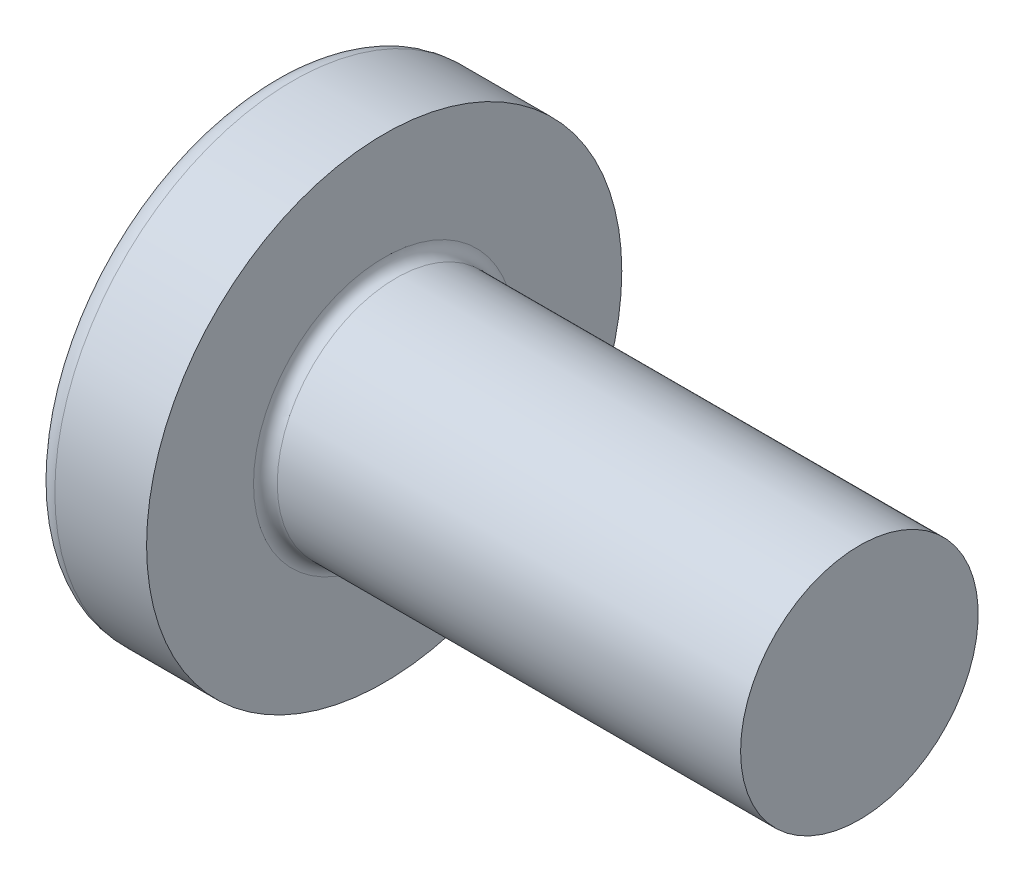
ISO-10303-21;
HEADER;
FILE_DESCRIPTION(('STEP AP214'),'2;1');
FILE_NAME('part.step','',(''),(''),'','','');
FILE_SCHEMA(('AUTOMOTIVE_DESIGN { 1 0 10303 214 1 1 1 1 }'));
ENDSEC;
DATA;
#1=APPLICATION_CONTEXT('core data for automotive mechanical design processes');
#2=APPLICATION_PROTOCOL_DEFINITION('international standard','automotive_design',2000,#1);
#3=PRODUCT_CONTEXT('',#1,'mechanical');
#4=PRODUCT('Part','Part','',(#3));
#5=PRODUCT_RELATED_PRODUCT_CATEGORY('part','',(#4));
#6=PRODUCT_DEFINITION_FORMATION('','',#4);
#7=PRODUCT_DEFINITION_CONTEXT('part definition',#1,'design');
#8=PRODUCT_DEFINITION('design','',#6,#7);
#9=PRODUCT_DEFINITION_SHAPE('','',#8);
#10=(LENGTH_UNIT() NAMED_UNIT(*) SI_UNIT(.MILLI.,.METRE.));
#11=(NAMED_UNIT(*) PLANE_ANGLE_UNIT() SI_UNIT($,.RADIAN.));
#12=(NAMED_UNIT(*) SI_UNIT($,.STERADIAN.) SOLID_ANGLE_UNIT());
#13=UNCERTAINTY_MEASURE_WITH_UNIT(LENGTH_MEASURE(1.E-05),#10,'distance_accuracy_value','');
#14=(GEOMETRIC_REPRESENTATION_CONTEXT(3) GLOBAL_UNCERTAINTY_ASSIGNED_CONTEXT((#13)) GLOBAL_UNIT_ASSIGNED_CONTEXT((#10,
#11,#12)) REPRESENTATION_CONTEXT('',''));
#15=CARTESIAN_POINT('',(0.,0.,0.));
#16=DIRECTION('',(0.,0.,1.));
#17=DIRECTION('',(1.,0.,0.));
#18=AXIS2_PLACEMENT_3D('',#15,#16,#17);
#19=CARTESIAN_POINT('',(6.5,0.,0.));
#20=DIRECTION('',(-1.,0.,0.));
#21=DIRECTION('',(0.,1.,0.));
#22=AXIS2_PLACEMENT_3D('',#19,#20,#21);
#23=SPHERICAL_SURFACE('',#22,6.5);
#24=CARTESIAN_POINT('',(1.26538895452803,0.,0.));
#25=DIRECTION('',(-1.,0.,0.));
#26=DIRECTION('',(0.,0.,1.));
#27=AXIS2_PLACEMENT_3D('',#24,#25,#26);
#28=CIRCLE('',#27,3.85342019543974);
#29=CARTESIAN_POINT('',(1.26538895452803,0.,3.85342019543974));
#30=VERTEX_POINT('',#29);
#31=EDGE_CURVE('E213',#30,#30,#28,.T.);
#32=ORIENTED_EDGE('',*,*,#31,.T.);
#33=EDGE_LOOP('',(#32));
#34=FACE_BOUND('',#33,.T.);
#35=CARTESIAN_POINT('',(0.0788099820016241,0.,0.));
#36=DIRECTION('',(1.,0.,0.));
#37=DIRECTION('',(0.,0.,-1.));
#38=AXIS2_PLACEMENT_3D('',#35,#36,#37);
#39=CIRCLE('',#38,1.0091178091571);
#40=CARTESIAN_POINT('',(0.0788099820016251,-0.514999999999997,-0.867809744562727));
#41=VERTEX_POINT('',#40);
#42=CARTESIAN_POINT('',(0.0788099820016241,-0.867809744562722,-0.515));
#43=VERTEX_POINT('',#42);
#44=EDGE_CURVE('E402',#41,#43,#39,.F.);
#45=ORIENTED_EDGE('',*,*,#44,.F.);
#46=CARTESIAN_POINT('',(6.5,-0.515,0.));
#47=DIRECTION('',(0.,1.,0.));
#48=DIRECTION('',(0.,0.,1.));
#49=AXIS2_PLACEMENT_3D('',#46,#47,#48);
#50=CIRCLE('',#49,6.47956595768575);
#51=CARTESIAN_POINT('',(0.331830514069448,-0.514999999999993,-1.98455541440274));
#52=VERTEX_POINT('',#51);
#53=EDGE_CURVE('E258',#52,#41,#50,.T.);
#54=ORIENTED_EDGE('',*,*,#53,.F.);
#55=CARTESIAN_POINT('',(6.06443205224295,0.,0.873614180207961));
#56=DIRECTION('',(0.446197800778958,0.,-0.89493436774996));
#57=DIRECTION('',(-0.89493436774996,0.,-0.446197800778958));
#58=AXIS2_PLACEMENT_3D('',#55,#56,#57);
#59=CIRCLE('',#58,6.4262803258982);
#60=CARTESIAN_POINT('',(0.331830514069448,0.515000000000007,-1.98455541440274));
#61=VERTEX_POINT('',#60);
#62=EDGE_CURVE('E232',#52,#61,#59,.T.);
#63=ORIENTED_EDGE('',*,*,#62,.T.);
#64=CARTESIAN_POINT('',(6.5,0.515,0.));
#65=DIRECTION('',(0.,-1.,0.));
#66=DIRECTION('',(0.,0.,-1.));
#67=AXIS2_PLACEMENT_3D('',#64,#65,#66);
#68=CIRCLE('',#67,6.47956595768575);
#69=CARTESIAN_POINT('',(0.0788099820016249,0.515000000000003,-0.867809744562724));
#70=VERTEX_POINT('',#69);
#71=EDGE_CURVE('E266',#70,#61,#68,.T.);
#72=ORIENTED_EDGE('',*,*,#71,.F.);
#73=CARTESIAN_POINT('',(0.0788099820016241,0.867809744562721,-0.515));
#74=VERTEX_POINT('',#73);
#75=EDGE_CURVE('E334',#74,#70,#39,.F.);
#76=ORIENTED_EDGE('',*,*,#75,.F.);
#77=CARTESIAN_POINT('',(6.5,0.,-0.515));
#78=DIRECTION('',(0.,0.,1.));
#79=DIRECTION('',(1.,0.,0.));
#80=AXIS2_PLACEMENT_3D('',#77,#78,#79);
#81=CIRCLE('',#80,6.47956595768575);
#82=CARTESIAN_POINT('',(0.331830514069448,1.98455541440274,-0.515));
#83=VERTEX_POINT('',#82);
#84=EDGE_CURVE('E226',#83,#74,#81,.T.);
#85=ORIENTED_EDGE('',*,*,#84,.F.);
#86=CARTESIAN_POINT('',(6.06443205224295,-0.873614180207961,0.));
#87=DIRECTION('',(0.446197800778958,0.89493436774996,0.));
#88=DIRECTION('',(-0.89493436774996,0.446197800778958,0.));
#89=AXIS2_PLACEMENT_3D('',#86,#87,#88);
#90=CIRCLE('',#89,6.4262803258982);
#91=CARTESIAN_POINT('',(0.331830514069448,1.98455541440274,0.515));
#92=VERTEX_POINT('',#91);
#93=EDGE_CURVE('E229',#83,#92,#90,.T.);
#94=ORIENTED_EDGE('',*,*,#93,.T.);
#95=CARTESIAN_POINT('',(6.5,0.,0.515));
#96=DIRECTION('',(0.,0.,-1.));
#97=DIRECTION('',(0.,1.,0.));
#98=AXIS2_PLACEMENT_3D('',#95,#96,#97);
#99=CIRCLE('',#98,6.47956595768575);
#100=CARTESIAN_POINT('',(0.0788099820016245,0.867809744562719,0.515));
#101=VERTEX_POINT('',#100);
#102=EDGE_CURVE('E222',#101,#92,#99,.T.);
#103=ORIENTED_EDGE('',*,*,#102,.F.);
#104=CARTESIAN_POINT('',(0.0788099820016251,0.514999999999997,0.867809744562727));
#105=VERTEX_POINT('',#104);
#106=EDGE_CURVE('E364',#105,#101,#39,.F.);
#107=ORIENTED_EDGE('',*,*,#106,.F.);
#108=CARTESIAN_POINT('',(0.331830514069448,0.514999999999993,1.98455541440274));
#109=VERTEX_POINT('',#108);
#110=EDGE_CURVE('E242',#109,#105,#68,.T.);
#111=ORIENTED_EDGE('',*,*,#110,.F.);
#112=CARTESIAN_POINT('',(6.06443205224295,0.,-0.873614180207961));
#113=DIRECTION('',(0.446197800778958,0.,0.89493436774996));
#114=DIRECTION('',(0.89493436774996,0.,-0.446197800778958));
#115=AXIS2_PLACEMENT_3D('',#112,#113,#114);
#116=CIRCLE('',#115,6.4262803258982);
#117=CARTESIAN_POINT('',(0.331830514069448,-0.515000000000007,1.98455541440274));
#118=VERTEX_POINT('',#117);
#119=EDGE_CURVE('E50',#109,#118,#116,.T.);
#120=ORIENTED_EDGE('',*,*,#119,.T.);
#121=CARTESIAN_POINT('',(0.0788099820016253,-0.515000000000003,0.867809744562724));
#122=VERTEX_POINT('',#121);
#123=EDGE_CURVE('E239',#122,#118,#50,.T.);
#124=ORIENTED_EDGE('',*,*,#123,.F.);
#125=CARTESIAN_POINT('',(0.0788099820016245,-0.86780974456272,0.514999999999999));
#126=VERTEX_POINT('',#125);
#127=EDGE_CURVE('E398',#126,#122,#39,.F.);
#128=ORIENTED_EDGE('',*,*,#127,.F.);
#129=CARTESIAN_POINT('',(0.331830514069447,-1.98455541440274,0.515));
#130=VERTEX_POINT('',#129);
#131=EDGE_CURVE('E223',#130,#126,#99,.T.);
#132=ORIENTED_EDGE('',*,*,#131,.F.);
#133=CARTESIAN_POINT('',(6.06443205224295,0.873614180207961,0.));
#134=DIRECTION('',(0.446197800778958,-0.89493436774996,0.));
#135=DIRECTION('',(0.89493436774996,0.446197800778958,0.));
#136=AXIS2_PLACEMENT_3D('',#133,#134,#135);
#137=CIRCLE('',#136,6.4262803258982);
#138=CARTESIAN_POINT('',(0.331830514069447,-1.98455541440274,-0.515));
#139=VERTEX_POINT('',#138);
#140=EDGE_CURVE('E219',#130,#139,#137,.T.);
#141=ORIENTED_EDGE('',*,*,#140,.T.);
#142=EDGE_CURVE('E65',#43,#139,#81,.T.);
#143=ORIENTED_EDGE('',*,*,#142,.F.);
#144=EDGE_LOOP('',(#45,#54,#63,#72,#76,#85,#94,#103,#107,#111,#120,#124,#128,#132,#141,#143));
#145=FACE_BOUND('',#144,.T.);
#146=ADVANCED_FACE('F37',(#34,#145),#23,.T.);
#147=CARTESIAN_POINT('',(0.,2.15,-0.515));
#148=DIRECTION('',(0.,0.,1.));
#149=DIRECTION('',(1.,0.,0.));
#150=AXIS2_PLACEMENT_3D('',#147,#148,#149);
#151=PLANE('',#150);
#152=ORIENTED_EDGE('',*,*,#84,.T.);
#153=CARTESIAN_POINT('',(-1.51195208675156,0.994972220320187,-0.515));
#154=CARTESIAN_POINT('',(-1.20405981949279,0.970722016949957,-0.515));
#155=CARTESIAN_POINT('',(-0.896180907521174,0.94629910991965,-0.515));
#156=CARTESIAN_POINT('',(-0.280449079832185,0.896981122427851,-0.515));
#157=CARTESIAN_POINT('',(0.0274038344396872,0.872086023934882,-0.515));
#158=CARTESIAN_POINT('',(0.489146739515351,0.83429553519528,-0.515));
#159=CARTESIAN_POINT('',(0.643055047553846,0.821624058404092,-0.515));
#160=CARTESIAN_POINT('',(0.950856520197141,0.796108332639504,-0.515));
#161=CARTESIAN_POINT('',(1.10474968487868,0.783264084592465,-0.515));
#162=CARTESIAN_POINT('',(1.41251352095103,0.757376569093378,-0.515));
#163=CARTESIAN_POINT('',(1.56638419296577,0.744333309065218,-0.515));
#164=CARTESIAN_POINT('',(1.87410847343335,0.718013273188896,-0.515));
#165=CARTESIAN_POINT('',(2.02796208151372,0.704736492982792,-0.515));
#166=CARTESIAN_POINT('',(2.36455311890989,0.675386943006726,-0.515));
#167=CARTESIAN_POINT('',(2.54728562293342,0.659257575640986,-0.515));
#168=CARTESIAN_POINT('',(2.91270624109256,0.626517182479888,-0.515));
#169=CARTESIAN_POINT('',(3.09539435554037,0.609906160177238,-0.515));
#170=CARTESIAN_POINT('',(3.46069832191612,0.576073027116422,-0.515));
#171=CARTESIAN_POINT('',(3.64331417870068,0.558850968932728,-0.515));
#172=CARTESIAN_POINT('',(4.00847437496567,0.523604864540038,-0.515));
#173=CARTESIAN_POINT('',(4.19101871216888,0.505580794604253,-0.515));
#174=CARTESIAN_POINT('',(4.55606208157937,0.468429191666488,-0.515));
#175=CARTESIAN_POINT('',(4.73856107358022,0.449301262281854,-0.515));
#176=CARTESIAN_POINT('',(5.10337547353418,0.409473604748925,-0.515));
#177=CARTESIAN_POINT('',(5.28569089526422,0.38877400510607,-0.515));
#178=CARTESIAN_POINT('',(5.55897278495412,0.355828287527265,-0.515));
#179=CARTESIAN_POINT('',(5.65005277419686,0.344527918782739,-0.515));
#180=CARTESIAN_POINT('',(5.83209904103607,0.321075174263032,-0.515));
#181=CARTESIAN_POINT('',(5.92306532397915,0.308922840209687,-0.515));
#182=CARTESIAN_POINT('',(6.10486078872898,0.283427334451931,-0.515));
#183=CARTESIAN_POINT('',(6.19568992299379,0.270083817601715,-0.515));
#184=CARTESIAN_POINT('',(6.33172773785679,0.248701420809952,-0.515));
#185=CARTESIAN_POINT('',(6.37704304473344,0.241345446705305,-0.515));
#186=CARTESIAN_POINT('',(6.4675722520141,0.226018953559339,-0.515));
#187=CARTESIAN_POINT('',(6.51278614568083,0.218048394864477,-0.515));
#188=CARTESIAN_POINT('',(6.55793125759548,0.209691465274946,-0.515));
#189=B_SPLINE_CURVE_WITH_KNOTS('',3,(#153,#154,#155,#156,#157,#158,#159,#160,#161,#162,#163,
#164,#165,#166,#167,#168,#169,#170,#171,#172,#173,#174,#175,#176,#177,#178,#179,#180,#181,#182,
#183,#184,#185,#186,#187,#188),.UNSPECIFIED.,.F.,.F.,(4,2,2,2,2,2,2,2,2,2,2,2,2,2,2,2,2,4),(0.,
0.92653770978172,1.85311087258339,2.31639796016285,2.77968256468771,3.24294992902054,
3.70622594801777,4.25655436065378,4.80687878359543,5.35715597005738,5.90744944680717,
6.45794177197673,7.00838913527399,7.28372117336898,7.55903973750591,7.83443833587748,
7.97216007460854,8.10989070671571),.UNSPECIFIED.);
#190=CARTESIAN_POINT('',(2.34,0.677477674908923,-0.515));
#191=VERTEX_POINT('',#190);
#192=EDGE_CURVE('E327',#74,#191,#189,.T.);
#193=ORIENTED_EDGE('',*,*,#192,.T.);
#194=DIRECTION('',(0.,1.,0.));
#195=VECTOR('',#194,1.);
#196=CARTESIAN_POINT('',(2.34,-0.983319077411408,-0.515));
#197=LINE('',#196,#195);
#198=CARTESIAN_POINT('',(2.34,0.983319077411408,-0.515));
#199=VERTEX_POINT('',#198);
#200=EDGE_CURVE('E281',#191,#199,#197,.T.);
#201=ORIENTED_EDGE('',*,*,#200,.T.);
#202=DIRECTION('',(0.89493436774996,-0.446197800778958,0.));
#203=VECTOR('',#202,1.);
#204=CARTESIAN_POINT('',(0.,2.15,-0.515));
#205=LINE('',#204,#203);
#206=EDGE_CURVE('E287',#83,#199,#205,.T.);
#207=ORIENTED_EDGE('',*,*,#206,.F.);
#208=EDGE_LOOP('',(#152,#193,#201,#207));
#209=FACE_BOUND('',#208,.T.);
#210=ADVANCED_FACE('F171',(#209),#151,.T.);
#211=CARTESIAN_POINT('',(2.34,-0.983319077411408,-0.515));
#212=VERTEX_POINT('',#211);
#213=CARTESIAN_POINT('',(2.34,-0.677477674908923,-0.515));
#214=VERTEX_POINT('',#213);
#215=EDGE_CURVE('E278',#212,#214,#197,.T.);
#216=ORIENTED_EDGE('',*,*,#215,.T.);
#217=CARTESIAN_POINT('',(-1.51195208675156,-0.994972220320187,-0.515));
#218=CARTESIAN_POINT('',(-1.20405981949279,-0.970722016949957,-0.515));
#219=CARTESIAN_POINT('',(-0.896180907521174,-0.94629910991965,-0.515));
#220=CARTESIAN_POINT('',(-0.280449079832185,-0.896981122427851,-0.515));
#221=CARTESIAN_POINT('',(0.0274038344396872,-0.872086023934882,-0.515));
#222=CARTESIAN_POINT('',(0.489146739515351,-0.83429553519528,-0.515));
#223=CARTESIAN_POINT('',(0.643055047553846,-0.821624058404092,-0.515));
#224=CARTESIAN_POINT('',(0.950856520197141,-0.796108332639504,-0.515));
#225=CARTESIAN_POINT('',(1.10474968487868,-0.783264084592465,-0.515));
#226=CARTESIAN_POINT('',(1.41251352095103,-0.757376569093378,-0.515));
#227=CARTESIAN_POINT('',(1.56638419296577,-0.744333309065218,-0.515));
#228=CARTESIAN_POINT('',(1.87410847343335,-0.718013273188896,-0.515));
#229=CARTESIAN_POINT('',(2.02796208151372,-0.704736492982792,-0.515));
#230=CARTESIAN_POINT('',(2.36455311890989,-0.675386943006726,-0.515));
#231=CARTESIAN_POINT('',(2.54728562293342,-0.659257575640986,-0.515));
#232=CARTESIAN_POINT('',(2.91270624109256,-0.626517182479888,-0.515));
#233=CARTESIAN_POINT('',(3.09539435554038,-0.609906160177238,-0.515));
#234=CARTESIAN_POINT('',(3.46069832191613,-0.576073027116421,-0.515));
#235=CARTESIAN_POINT('',(3.64331417870068,-0.558850968932727,-0.515));
#236=CARTESIAN_POINT('',(4.00847437496567,-0.523604864540037,-0.515));
#237=CARTESIAN_POINT('',(4.19101871216888,-0.505580794604253,-0.515));
#238=CARTESIAN_POINT('',(4.55606208157937,-0.468429191666488,-0.515));
#239=CARTESIAN_POINT('',(4.73856107358023,-0.449301262281854,-0.515));
#240=CARTESIAN_POINT('',(5.10337547353419,-0.409473604748925,-0.515));
#241=CARTESIAN_POINT('',(5.28569089526422,-0.38877400510607,-0.515));
#242=CARTESIAN_POINT('',(5.55897278495412,-0.355828287527264,-0.515));
#243=CARTESIAN_POINT('',(5.65005277419686,-0.344527918782738,-0.515));
#244=CARTESIAN_POINT('',(5.83209904103608,-0.321075174263031,-0.515));
#245=CARTESIAN_POINT('',(5.92306532397915,-0.308922840209686,-0.515));
#246=CARTESIAN_POINT('',(6.10486078872898,-0.283427334451931,-0.515));
#247=CARTESIAN_POINT('',(6.1956899229938,-0.270083817601715,-0.515));
#248=CARTESIAN_POINT('',(6.33172773785679,-0.248701420809952,-0.515));
#249=CARTESIAN_POINT('',(6.37704304473344,-0.241345446705305,-0.515));
#250=CARTESIAN_POINT('',(6.4675722520141,-0.226018953559339,-0.515));
#251=CARTESIAN_POINT('',(6.51278614568083,-0.218048394864477,-0.515));
#252=CARTESIAN_POINT('',(6.55793125759549,-0.209691465274945,-0.515));
#253=B_SPLINE_CURVE_WITH_KNOTS('',3,(#217,#218,#219,#220,#221,#222,#223,#224,#225,#226,#227,
#228,#229,#230,#231,#232,#233,#234,#235,#236,#237,#238,#239,#240,#241,#242,#243,#244,#245,#246,
#247,#248,#249,#250,#251,#252),.UNSPECIFIED.,.F.,.F.,(4,2,2,2,2,2,2,2,2,2,2,2,2,2,2,2,2,4),(0.,
0.92653770978172,1.85311087258339,2.31639796016285,2.77968256468771,3.24294992902054,
3.70622594801777,4.25655436065378,4.80687878359543,5.35715597005738,5.90744944680718,
6.45794177197673,7.008389135274,7.28372117336899,7.55903973750591,7.83443833587748,
7.97216007460854,8.10989070671571),.UNSPECIFIED.);
#254=EDGE_CURVE('E320',#214,#43,#253,.F.);
#255=ORIENTED_EDGE('',*,*,#254,.T.);
#256=ORIENTED_EDGE('',*,*,#142,.T.);
#257=DIRECTION('',(0.89493436774996,0.446197800778958,0.));
#258=VECTOR('',#257,1.);
#259=CARTESIAN_POINT('',(0.,-2.15,-0.515));
#260=LINE('',#259,#258);
#261=EDGE_CURVE('E284',#139,#212,#260,.T.);
#262=ORIENTED_EDGE('',*,*,#261,.T.);
#263=EDGE_LOOP('',(#216,#255,#256,#262));
#264=FACE_BOUND('',#263,.T.);
#265=ADVANCED_FACE('F177',(#264),#151,.T.);
#266=CARTESIAN_POINT('',(0.,-2.15,0.515));
#267=DIRECTION('',(0.,0.,-1.));
#268=DIRECTION('',(0.,1.,0.));
#269=AXIS2_PLACEMENT_3D('',#266,#267,#268);
#270=PLANE('',#269);
#271=DIRECTION('',(0.,-1.,0.));
#272=VECTOR('',#271,1.);
#273=CARTESIAN_POINT('',(2.34,0.983319077411408,0.515));
#274=LINE('',#273,#272);
#275=CARTESIAN_POINT('',(2.34,0.983319077411408,0.515));
#276=VERTEX_POINT('',#275);
#277=CARTESIAN_POINT('',(2.34,0.677477674908923,0.515));
#278=VERTEX_POINT('',#277);
#279=EDGE_CURVE('E271',#276,#278,#274,.T.);
#280=ORIENTED_EDGE('',*,*,#279,.T.);
#281=CARTESIAN_POINT('',(-1.51195208754037,0.994972220382297,0.515));
#282=CARTESIAN_POINT('',(-1.20405982018868,0.970722017005064,0.515));
#283=CARTESIAN_POINT('',(-0.896180908124143,0.946299109967688,0.515));
#284=CARTESIAN_POINT('',(-0.280449080249312,0.896981122461527,0.515));
#285=CARTESIAN_POINT('',(0.0274038341154852,0.872086023961265,0.515));
#286=CARTESIAN_POINT('',(0.489146739371409,0.834295535207136,0.515));
#287=CARTESIAN_POINT('',(0.643055047497245,0.821624058408796,0.515));
#288=CARTESIAN_POINT('',(0.950856520315204,0.796108332629705,0.515));
#289=CARTESIAN_POINT('',(1.10474968508407,0.783264084575317,0.515));
#290=CARTESIAN_POINT('',(1.41251352133103,0.757376569061287,0.515));
#291=CARTESIAN_POINT('',(1.56638419343305,0.744333309025534,0.515));
#292=CARTESIAN_POINT('',(1.87410847407519,0.718013273133716,0.515));
#293=CARTESIAN_POINT('',(2.02796208224283,0.70473649291971,0.515));
#294=CARTESIAN_POINT('',(2.36455311972626,0.675386942934956,0.515));
#295=CARTESIAN_POINT('',(2.5472856237498,0.659257575568568,0.515));
#296=CARTESIAN_POINT('',(2.91270624190895,0.626517182406014,0.515));
#297=CARTESIAN_POINT('',(3.09539435635676,0.609906160102554,0.515));
#298=CARTESIAN_POINT('',(3.46069832273244,0.576073027039889,0.515));
#299=CARTESIAN_POINT('',(3.64331417951694,0.558850968855157,0.515));
#300=CARTESIAN_POINT('',(4.00847437578178,0.523604864460044,0.515));
#301=CARTESIAN_POINT('',(4.1910187129849,0.505580794522876,0.515));
#302=CARTESIAN_POINT('',(4.55606208239526,0.46842919158178,0.515));
#303=CARTESIAN_POINT('',(4.73856107439606,0.449301262195198,0.515));
#304=CARTESIAN_POINT('',(5.10337547434977,0.409473604657435,0.515));
#305=CARTESIAN_POINT('',(5.28569089607961,0.388774005011695,0.515));
#306=CARTESIAN_POINT('',(5.55897278576906,0.355828287427083,0.515));
#307=CARTESIAN_POINT('',(5.65005277501166,0.344527918680369,0.515));
#308=CARTESIAN_POINT('',(5.83209904185046,0.3210751741555,0.515));
#309=CARTESIAN_POINT('',(5.92306532479326,0.308922840099181,0.515));
#310=CARTESIAN_POINT('',(6.10486078954238,0.283427334334153,0.515));
#311=CARTESIAN_POINT('',(6.19568992380676,0.270083817479638,0.515));
#312=CARTESIAN_POINT('',(6.33172773866873,0.24870142067948,0.515));
#313=CARTESIAN_POINT('',(6.377043045545,0.241345446571708,0.515));
#314=CARTESIAN_POINT('',(6.46757225282465,0.226018953418424,0.515));
#315=CARTESIAN_POINT('',(6.51278614649077,0.21804839471937,0.515));
#316=CARTESIAN_POINT('',(6.55793125840465,0.209691465124902,0.515));
#317=B_SPLINE_CURVE_WITH_KNOTS('',3,(#281,#282,#283,#284,#285,#286,#287,#288,#289,#290,#291,
#292,#293,#294,#295,#296,#297,#298,#299,#300,#301,#302,#303,#304,#305,#306,#307,#308,#309,#310,
#311,#312,#313,#314,#315,#316),.UNSPECIFIED.,.F.,.F.,(4,2,2,2,2,2,2,2,2,2,2,2,2,2,2,2,2,4),(0.,
0.926537710061278,1.85311087314258,2.31639796098494,2.77968256577269,3.24294993036838,
3.70622594962848,4.25655436226469,4.80687878520654,5.3571559716686,5.90744944841855,
6.45794177358856,7.00838913688618,7.28372117498156,7.55903973911884,7.83443833749096,
7.97216007622236,8.10989070832989),.UNSPECIFIED.);
#318=EDGE_CURVE('E365',#278,#101,#317,.F.);
#319=ORIENTED_EDGE('',*,*,#318,.T.);
#320=ORIENTED_EDGE('',*,*,#102,.T.);
#321=DIRECTION('',(0.89493436774996,-0.446197800778958,0.));
#322=VECTOR('',#321,1.);
#323=CARTESIAN_POINT('',(0.,2.15,0.515));
#324=LINE('',#323,#322);
#325=EDGE_CURVE('E286',#92,#276,#324,.T.);
#326=ORIENTED_EDGE('',*,*,#325,.T.);
#327=EDGE_LOOP('',(#280,#319,#320,#326));
#328=FACE_BOUND('',#327,.T.);
#329=ADVANCED_FACE('F315',(#328),#270,.T.);
#330=ORIENTED_EDGE('',*,*,#131,.T.);
#331=CARTESIAN_POINT('',(-1.51195208754037,-0.994972220382297,0.515));
#332=CARTESIAN_POINT('',(-1.20405982018868,-0.970722017005064,0.515));
#333=CARTESIAN_POINT('',(-0.896180908124144,-0.946299109967688,0.515));
#334=CARTESIAN_POINT('',(-0.280449080249312,-0.896981122461527,0.515));
#335=CARTESIAN_POINT('',(0.0274038341154852,-0.872086023961264,0.515));
#336=CARTESIAN_POINT('',(0.489146739371408,-0.834295535207136,0.515));
#337=CARTESIAN_POINT('',(0.643055047497245,-0.821624058408796,0.515));
#338=CARTESIAN_POINT('',(0.950856520315204,-0.796108332629705,0.515));
#339=CARTESIAN_POINT('',(1.10474968508407,-0.783264084575317,0.515));
#340=CARTESIAN_POINT('',(1.41251352133103,-0.757376569061287,0.515));
#341=CARTESIAN_POINT('',(1.56638419343305,-0.744333309025534,0.515));
#342=CARTESIAN_POINT('',(1.87410847407519,-0.718013273133716,0.515));
#343=CARTESIAN_POINT('',(2.02796208224283,-0.70473649291971,0.515));
#344=CARTESIAN_POINT('',(2.36455311972626,-0.675386942934956,0.515));
#345=CARTESIAN_POINT('',(2.5472856237498,-0.659257575568568,0.515));
#346=CARTESIAN_POINT('',(2.91270624190895,-0.626517182406014,0.515));
#347=CARTESIAN_POINT('',(3.09539435635676,-0.609906160102555,0.515));
#348=CARTESIAN_POINT('',(3.46069832273244,-0.57607302703989,0.515));
#349=CARTESIAN_POINT('',(3.64331417951694,-0.558850968855157,0.515));
#350=CARTESIAN_POINT('',(4.00847437578178,-0.523604864460045,0.515));
#351=CARTESIAN_POINT('',(4.1910187129849,-0.505580794522877,0.515));
#352=CARTESIAN_POINT('',(4.55606208239525,-0.46842919158178,0.515));
#353=CARTESIAN_POINT('',(4.73856107439606,-0.449301262195199,0.515));
#354=CARTESIAN_POINT('',(5.10337547434977,-0.409473604657436,0.515));
#355=CARTESIAN_POINT('',(5.2856908960796,-0.388774005011696,0.515));
#356=CARTESIAN_POINT('',(5.55897278576906,-0.355828287427083,0.515));
#357=CARTESIAN_POINT('',(5.65005277501166,-0.34452791868037,0.515));
#358=CARTESIAN_POINT('',(5.83209904185046,-0.321075174155501,0.515));
#359=CARTESIAN_POINT('',(5.92306532479326,-0.308922840099182,0.515));
#360=CARTESIAN_POINT('',(6.10486078954238,-0.283427334334154,0.515));
#361=CARTESIAN_POINT('',(6.19568992380675,-0.270083817479639,0.515));
#362=CARTESIAN_POINT('',(6.33172773866873,-0.24870142067948,0.515));
#363=CARTESIAN_POINT('',(6.37704304554499,-0.241345446571709,0.515));
#364=CARTESIAN_POINT('',(6.46757225282465,-0.226018953418425,0.515));
#365=CARTESIAN_POINT('',(6.51278614649077,-0.21804839471937,0.515));
#366=CARTESIAN_POINT('',(6.55793125840465,-0.209691465124903,0.515));
#367=B_SPLINE_CURVE_WITH_KNOTS('',3,(#331,#332,#333,#334,#335,#336,#337,#338,#339,#340,#341,
#342,#343,#344,#345,#346,#347,#348,#349,#350,#351,#352,#353,#354,#355,#356,#357,#358,#359,#360,
#361,#362,#363,#364,#365,#366),.UNSPECIFIED.,.F.,.F.,(4,2,2,2,2,2,2,2,2,2,2,2,2,2,2,2,2,4),(0.,
0.926537710061277,1.85311087314258,2.31639796098494,2.77968256577269,3.24294993036838,
3.70622594962848,4.25655436226469,4.80687878520654,5.3571559716686,5.90744944841854,
6.45794177358856,7.00838913688618,7.28372117498156,7.55903973911884,7.83443833749095,
7.97216007622235,8.10989070832989),.UNSPECIFIED.);
#368=CARTESIAN_POINT('',(2.34,-0.677477674908923,0.515));
#369=VERTEX_POINT('',#368);
#370=EDGE_CURVE('E355',#126,#369,#367,.T.);
#371=ORIENTED_EDGE('',*,*,#370,.T.);
#372=CARTESIAN_POINT('',(2.34,-0.983319077411408,0.515));
#373=VERTEX_POINT('',#372);
#374=EDGE_CURVE('E274',#369,#373,#274,.T.);
#375=ORIENTED_EDGE('',*,*,#374,.T.);
#376=DIRECTION('',(0.89493436774996,0.446197800778958,0.));
#377=VECTOR('',#376,1.);
#378=CARTESIAN_POINT('',(0.,-2.15,0.515));
#379=LINE('',#378,#377);
#380=EDGE_CURVE('E270',#130,#373,#379,.T.);
#381=ORIENTED_EDGE('',*,*,#380,.F.);
#382=EDGE_LOOP('',(#330,#371,#375,#381));
#383=FACE_BOUND('',#382,.T.);
#384=ADVANCED_FACE('F383',(#383),#270,.T.);
#385=CARTESIAN_POINT('',(2.34,0.983319077411408,-0.515));
#386=DIRECTION('',(-1.,0.,0.));
#387=DIRECTION('',(0.,0.,1.));
#388=AXIS2_PLACEMENT_3D('',#385,#386,#387);
#389=PLANE('',#388);
#390=ORIENTED_EDGE('',*,*,#374,.F.);
#391=CARTESIAN_POINT('',(2.34,0.,0.));
#392=DIRECTION('',(-1.,0.,0.));
#393=DIRECTION('',(0.,0.,1.));
#394=AXIS2_PLACEMENT_3D('',#391,#392,#393);
#395=CIRCLE('',#394,0.851);
#396=EDGE_CURVE('E397',#214,#369,#395,.T.);
#397=ORIENTED_EDGE('',*,*,#396,.F.);
#398=ORIENTED_EDGE('',*,*,#215,.F.);
#399=DIRECTION('',(0.,0.,1.));
#400=VECTOR('',#399,1.);
#401=CARTESIAN_POINT('',(2.34,-0.983319077411408,-0.515));
#402=LINE('',#401,#400);
#403=EDGE_CURVE('E267',#212,#373,#402,.T.);
#404=ORIENTED_EDGE('',*,*,#403,.T.);
#405=EDGE_LOOP('',(#390,#397,#398,#404));
#406=FACE_BOUND('',#405,.T.);
#407=ADVANCED_FACE('F380',(#406),#389,.T.);
#408=DIRECTION('',(0.,0.,-1.));
#409=VECTOR('',#408,1.);
#410=CARTESIAN_POINT('',(2.34,-0.515000000000004,0.983319077411407));
#411=LINE('',#410,#409);
#412=CARTESIAN_POINT('',(2.34,-0.514999999999998,-0.677477674908924));
#413=VERTEX_POINT('',#412);
#414=CARTESIAN_POINT('',(2.34,-0.514999999999996,-0.98331907741141));
#415=VERTEX_POINT('',#414);
#416=EDGE_CURVE('E424',#413,#415,#411,.T.);
#417=ORIENTED_EDGE('',*,*,#416,.F.);
#418=CARTESIAN_POINT('',(2.34,0.515000000000002,-0.677477674908921));
#419=VERTEX_POINT('',#418);
#420=EDGE_CURVE('E57',#419,#413,#395,.T.);
#421=ORIENTED_EDGE('',*,*,#420,.F.);
#422=DIRECTION('',(0.,0.,1.));
#423=VECTOR('',#422,1.);
#424=CARTESIAN_POINT('',(2.34,0.515000000000004,-0.983319077411407));
#425=LINE('',#424,#423);
#426=CARTESIAN_POINT('',(2.34,0.515000000000004,-0.983319077411407));
#427=VERTEX_POINT('',#426);
#428=EDGE_CURVE('E423',#427,#419,#425,.T.);
#429=ORIENTED_EDGE('',*,*,#428,.F.);
#430=DIRECTION('',(0.,-1.,0.));
#431=VECTOR('',#430,1.);
#432=CARTESIAN_POINT('',(2.34,0.515000000000004,-0.983319077411407));
#433=LINE('',#432,#431);
#434=EDGE_CURVE('E436',#427,#415,#433,.T.);
#435=ORIENTED_EDGE('',*,*,#434,.T.);
#436=EDGE_LOOP('',(#417,#421,#429,#435));
#437=FACE_BOUND('',#436,.T.);
#438=ADVANCED_FACE('F382',(#437),#389,.T.);
#439=ORIENTED_EDGE('',*,*,#200,.F.);
#440=EDGE_CURVE('E407',#278,#191,#395,.T.);
#441=ORIENTED_EDGE('',*,*,#440,.F.);
#442=ORIENTED_EDGE('',*,*,#279,.F.);
#443=DIRECTION('',(0.,0.,-1.));
#444=VECTOR('',#443,1.);
#445=CARTESIAN_POINT('',(2.34,0.983319077411408,0.515));
#446=LINE('',#445,#444);
#447=EDGE_CURVE('E275',#276,#199,#446,.T.);
#448=ORIENTED_EDGE('',*,*,#447,.T.);
#449=EDGE_LOOP('',(#439,#441,#442,#448));
#450=FACE_BOUND('',#449,.T.);
#451=ADVANCED_FACE('F457',(#450),#389,.T.);
#452=CARTESIAN_POINT('',(2.34,0.514999999999998,0.677477674908924));
#453=VERTEX_POINT('',#452);
#454=CARTESIAN_POINT('',(2.34,0.514999999999997,0.98331907741141));
#455=VERTEX_POINT('',#454);
#456=EDGE_CURVE('E256',#453,#455,#425,.T.);
#457=ORIENTED_EDGE('',*,*,#456,.F.);
#458=CARTESIAN_POINT('',(2.34,-0.515000000000003,0.677477674908921));
#459=VERTEX_POINT('',#458);
#460=EDGE_CURVE('E408',#459,#453,#395,.T.);
#461=ORIENTED_EDGE('',*,*,#460,.F.);
#462=CARTESIAN_POINT('',(2.34,-0.515000000000004,0.983319077411407));
#463=VERTEX_POINT('',#462);
#464=EDGE_CURVE('E439',#463,#459,#411,.T.);
#465=ORIENTED_EDGE('',*,*,#464,.F.);
#466=DIRECTION('',(0.,1.,0.));
#467=VECTOR('',#466,1.);
#468=CARTESIAN_POINT('',(2.34,-0.515000000000004,0.983319077411407));
#469=LINE('',#468,#467);
#470=EDGE_CURVE('E430',#463,#455,#469,.T.);
#471=ORIENTED_EDGE('',*,*,#470,.T.);
#472=EDGE_LOOP('',(#457,#461,#465,#471));
#473=FACE_BOUND('',#472,.T.);
#474=ADVANCED_FACE('F374',(#473),#389,.T.);
#475=CARTESIAN_POINT('',(0.,0.514999999999993,2.15));
#476=DIRECTION('',(0.,-1.,0.));
#477=DIRECTION('',(1.,0.,0.));
#478=AXIS2_PLACEMENT_3D('',#475,#476,#477);
#479=PLANE('',#478);
#480=ORIENTED_EDGE('',*,*,#110,.T.);
#481=CARTESIAN_POINT('',(-1.51195208754037,0.514999999999997,0.994972220382299));
#482=CARTESIAN_POINT('',(-1.20405982018868,0.514999999999997,0.970722017005065));
#483=CARTESIAN_POINT('',(-0.896180908124144,0.514999999999997,0.94629910996769));
#484=CARTESIAN_POINT('',(-0.280449080249312,0.514999999999997,0.896981122461529));
#485=CARTESIAN_POINT('',(0.0274038341154852,0.514999999999997,0.872086023961266));
#486=CARTESIAN_POINT('',(0.489146739371409,0.514999999999997,0.834295535207138));
#487=CARTESIAN_POINT('',(0.643055047497245,0.514999999999997,0.821624058408797));
#488=CARTESIAN_POINT('',(0.950856520315204,0.514999999999997,0.796108332629707));
#489=CARTESIAN_POINT('',(1.10474968508407,0.514999999999997,0.783264084575319));
#490=CARTESIAN_POINT('',(1.41251352133103,0.514999999999997,0.757376569061289));
#491=CARTESIAN_POINT('',(1.56638419343305,0.514999999999997,0.744333309025535));
#492=CARTESIAN_POINT('',(1.87410847407519,0.514999999999998,0.718013273133717));
#493=CARTESIAN_POINT('',(2.02796208224283,0.514999999999998,0.704736492919711));
#494=CARTESIAN_POINT('',(2.36455311972626,0.514999999999998,0.675386942934957));
#495=CARTESIAN_POINT('',(2.5472856237498,0.514999999999998,0.65925757556857));
#496=CARTESIAN_POINT('',(2.91270624190895,0.514999999999998,0.626517182406016));
#497=CARTESIAN_POINT('',(3.09539435635676,0.514999999999998,0.609906160102556));
#498=CARTESIAN_POINT('',(3.46069832273244,0.514999999999998,0.576073027039891));
#499=CARTESIAN_POINT('',(3.64331417951694,0.514999999999998,0.558850968855159));
#500=CARTESIAN_POINT('',(4.00847437578178,0.514999999999998,0.523604864460046));
#501=CARTESIAN_POINT('',(4.1910187129849,0.514999999999998,0.505580794522878));
#502=CARTESIAN_POINT('',(4.55606208239526,0.514999999999998,0.468429191581782));
#503=CARTESIAN_POINT('',(4.73856107439606,0.514999999999999,0.4493012621952));
#504=CARTESIAN_POINT('',(5.10337547434977,0.514999999999999,0.409473604657437));
#505=CARTESIAN_POINT('',(5.2856908960796,0.514999999999999,0.388774005011697));
#506=CARTESIAN_POINT('',(5.55897278576906,0.514999999999999,0.355828287427085));
#507=CARTESIAN_POINT('',(5.65005277501166,0.514999999999999,0.344527918680371));
#508=CARTESIAN_POINT('',(5.83209904185046,0.514999999999999,0.321075174155502));
#509=CARTESIAN_POINT('',(5.92306532479326,0.514999999999999,0.308922840099183));
#510=CARTESIAN_POINT('',(6.10486078954238,0.514999999999999,0.283427334334156));
#511=CARTESIAN_POINT('',(6.19568992380675,0.514999999999999,0.27008381747964));
#512=CARTESIAN_POINT('',(6.33172773866873,0.514999999999999,0.248701420679482));
#513=CARTESIAN_POINT('',(6.37704304554499,0.514999999999999,0.241345446571711));
#514=CARTESIAN_POINT('',(6.46757225282465,0.514999999999999,0.226018953418427));
#515=CARTESIAN_POINT('',(6.51278614649077,0.514999999999999,0.218048394719372));
#516=CARTESIAN_POINT('',(6.55793125840465,0.514999999999999,0.209691465124905));
#517=B_SPLINE_CURVE_WITH_KNOTS('',3,(#481,#482,#483,#484,#485,#486,#487,#488,#489,#490,#491,
#492,#493,#494,#495,#496,#497,#498,#499,#500,#501,#502,#503,#504,#505,#506,#507,#508,#509,#510,
#511,#512,#513,#514,#515,#516),.UNSPECIFIED.,.F.,.F.,(4,2,2,2,2,2,2,2,2,2,2,2,2,2,2,2,2,4),(0.,
0.926537710061277,1.85311087314258,2.31639796098494,2.77968256577269,3.24294993036838,
3.70622594962848,4.25655436226469,4.80687878520654,5.3571559716686,5.90744944841854,
6.45794177358856,7.00838913688618,7.28372117498156,7.55903973911883,7.83443833749095,
7.97216007622235,8.10989070832989),.UNSPECIFIED.);
#518=EDGE_CURVE('E360',#105,#453,#517,.T.);
#519=ORIENTED_EDGE('',*,*,#518,.T.);
#520=ORIENTED_EDGE('',*,*,#456,.T.);
#521=DIRECTION('',(0.89493436774996,0.,-0.446197800778958));
#522=VECTOR('',#521,1.);
#523=CARTESIAN_POINT('',(0.,0.514999999999993,2.15));
#524=LINE('',#523,#522);
#525=EDGE_CURVE('E249',#109,#455,#524,.T.);
#526=ORIENTED_EDGE('',*,*,#525,.F.);
#527=EDGE_LOOP('',(#480,#519,#520,#526));
#528=FACE_BOUND('',#527,.T.);
#529=ADVANCED_FACE('F253',(#528),#479,.T.);
#530=CARTESIAN_POINT('',(0.,-0.514999999999992,-2.15));
#531=DIRECTION('',(0.,1.,0.));
#532=DIRECTION('',(0.,0.,1.));
#533=AXIS2_PLACEMENT_3D('',#530,#531,#532);
#534=PLANE('',#533);
#535=ORIENTED_EDGE('',*,*,#464,.T.);
#536=CARTESIAN_POINT('',(-1.51195208675156,-0.515000000000004,0.994972220320185));
#537=CARTESIAN_POINT('',(-1.20405981949279,-0.515000000000003,0.970722016949956));
#538=CARTESIAN_POINT('',(-0.896180907521174,-0.515000000000003,0.946299109919649));
#539=CARTESIAN_POINT('',(-0.280449079832186,-0.515000000000003,0.896981122427849));
#540=CARTESIAN_POINT('',(0.0274038344396871,-0.515000000000003,0.872086023934881));
#541=CARTESIAN_POINT('',(0.489146739515351,-0.515000000000003,0.834295535195278));
#542=CARTESIAN_POINT('',(0.643055047553846,-0.515000000000003,0.82162405840409));
#543=CARTESIAN_POINT('',(0.950856520197141,-0.515000000000003,0.796108332639502));
#544=CARTESIAN_POINT('',(1.10474968487868,-0.515000000000003,0.783264084592463));
#545=CARTESIAN_POINT('',(1.41251352095103,-0.515000000000003,0.757376569093376));
#546=CARTESIAN_POINT('',(1.56638419296577,-0.515000000000003,0.744333309065216));
#547=CARTESIAN_POINT('',(1.87410847343335,-0.515000000000003,0.718013273188894));
#548=CARTESIAN_POINT('',(2.02796208151372,-0.515000000000002,0.70473649298279));
#549=CARTESIAN_POINT('',(2.36455311890989,-0.515000000000002,0.675386943006724));
#550=CARTESIAN_POINT('',(2.54728562293342,-0.515000000000002,0.659257575640984));
#551=CARTESIAN_POINT('',(2.91270624109256,-0.515000000000002,0.626517182479886));
#552=CARTESIAN_POINT('',(3.09539435554037,-0.515000000000002,0.609906160177237));
#553=CARTESIAN_POINT('',(3.46069832191612,-0.515000000000002,0.57607302711642));
#554=CARTESIAN_POINT('',(3.64331417870068,-0.515000000000002,0.558850968932726));
#555=CARTESIAN_POINT('',(4.00847437496567,-0.515000000000002,0.523604864540036));
#556=CARTESIAN_POINT('',(4.19101871216888,-0.515000000000002,0.505580794604251));
#557=CARTESIAN_POINT('',(4.55606208157937,-0.515000000000002,0.468429191666487));
#558=CARTESIAN_POINT('',(4.73856107358022,-0.515000000000002,0.449301262281852));
#559=CARTESIAN_POINT('',(5.10337547353418,-0.515000000000001,0.409473604748923));
#560=CARTESIAN_POINT('',(5.28569089526422,-0.515000000000001,0.388774005106068));
#561=CARTESIAN_POINT('',(5.55897278495412,-0.515000000000001,0.355828287527263));
#562=CARTESIAN_POINT('',(5.65005277419686,-0.515000000000001,0.344527918782737));
#563=CARTESIAN_POINT('',(5.83209904103607,-0.515000000000001,0.32107517426303));
#564=CARTESIAN_POINT('',(5.92306532397915,-0.515000000000001,0.308922840209685));
#565=CARTESIAN_POINT('',(6.10486078872898,-0.515000000000001,0.283427334451929));
#566=CARTESIAN_POINT('',(6.19568992299379,-0.515000000000001,0.270083817601713));
#567=CARTESIAN_POINT('',(6.33172773785679,-0.515000000000001,0.24870142080995));
#568=CARTESIAN_POINT('',(6.37704304473344,-0.515000000000001,0.241345446705303));
#569=CARTESIAN_POINT('',(6.4675722520141,-0.515000000000001,0.226018953559337));
#570=CARTESIAN_POINT('',(6.51278614568083,-0.515000000000001,0.218048394864476));
#571=CARTESIAN_POINT('',(6.55793125759548,-0.515000000000001,0.209691465274944));
#572=B_SPLINE_CURVE_WITH_KNOTS('',3,(#536,#537,#538,#539,#540,#541,#542,#543,#544,#545,#546,
#547,#548,#549,#550,#551,#552,#553,#554,#555,#556,#557,#558,#559,#560,#561,#562,#563,#564,#565,
#566,#567,#568,#569,#570,#571),.UNSPECIFIED.,.F.,.F.,(4,2,2,2,2,2,2,2,2,2,2,2,2,2,2,2,2,4),(0.,
0.92653770978172,1.85311087258339,2.31639796016285,2.77968256468771,3.24294992902054,
3.70622594801777,4.25655436065378,4.80687878359543,5.35715597005738,5.90744944680717,
6.45794177197673,7.008389135274,7.28372117336898,7.55903973750591,7.83443833587748,
7.97216007460854,8.10989070671571),.UNSPECIFIED.);
#573=EDGE_CURVE('E333',#459,#122,#572,.F.);
#574=ORIENTED_EDGE('',*,*,#573,.T.);
#575=ORIENTED_EDGE('',*,*,#123,.T.);
#576=DIRECTION('',(0.89493436774996,0.,-0.446197800778958));
#577=VECTOR('',#576,1.);
#578=CARTESIAN_POINT('',(0.,-0.515000000000008,2.15));
#579=LINE('',#578,#577);
#580=EDGE_CURVE('E251',#118,#463,#579,.T.);
#581=ORIENTED_EDGE('',*,*,#580,.T.);
#582=EDGE_LOOP('',(#535,#574,#575,#581));
#583=FACE_BOUND('',#582,.T.);
#584=ADVANCED_FACE('F373',(#583),#534,.T.);
#585=ORIENTED_EDGE('',*,*,#428,.T.);
#586=CARTESIAN_POINT('',(-1.51195208754037,0.515000000000004,-0.994972220382295));
#587=CARTESIAN_POINT('',(-1.20405982018868,0.515000000000003,-0.970722017005062));
#588=CARTESIAN_POINT('',(-0.896180908124144,0.515000000000003,-0.946299109967686));
#589=CARTESIAN_POINT('',(-0.280449080249312,0.515000000000003,-0.896981122461525));
#590=CARTESIAN_POINT('',(0.0274038341154851,0.515000000000003,-0.872086023961263));
#591=CARTESIAN_POINT('',(0.489146739371408,0.515000000000003,-0.834295535207134));
#592=CARTESIAN_POINT('',(0.643055047497245,0.515000000000003,-0.821624058408794));
#593=CARTESIAN_POINT('',(0.950856520315204,0.515000000000003,-0.796108332629703));
#594=CARTESIAN_POINT('',(1.10474968508407,0.515000000000003,-0.783264084575315));
#595=CARTESIAN_POINT('',(1.41251352133103,0.515000000000003,-0.757376569061285));
#596=CARTESIAN_POINT('',(1.56638419343305,0.515000000000003,-0.744333309025532));
#597=CARTESIAN_POINT('',(1.87410847407519,0.515000000000003,-0.718013273133714));
#598=CARTESIAN_POINT('',(2.02796208224283,0.515000000000002,-0.704736492919708));
#599=CARTESIAN_POINT('',(2.36455311972626,0.515000000000002,-0.675386942934954));
#600=CARTESIAN_POINT('',(2.5472856237498,0.515000000000002,-0.659257575568566));
#601=CARTESIAN_POINT('',(2.91270624190895,0.515000000000002,-0.626517182406012));
#602=CARTESIAN_POINT('',(3.09539435635676,0.515000000000002,-0.609906160102553));
#603=CARTESIAN_POINT('',(3.46069832273244,0.515000000000002,-0.576073027039888));
#604=CARTESIAN_POINT('',(3.64331417951694,0.515000000000002,-0.558850968855155));
#605=CARTESIAN_POINT('',(4.00847437578178,0.515000000000002,-0.523604864460043));
#606=CARTESIAN_POINT('',(4.1910187129849,0.515000000000002,-0.505580794522875));
#607=CARTESIAN_POINT('',(4.55606208239525,0.515000000000002,-0.468429191581779));
#608=CARTESIAN_POINT('',(4.73856107439606,0.515000000000002,-0.449301262195197));
#609=CARTESIAN_POINT('',(5.10337547434977,0.515000000000001,-0.409473604657434));
#610=CARTESIAN_POINT('',(5.2856908960796,0.515000000000001,-0.388774005011694));
#611=CARTESIAN_POINT('',(5.55897278576906,0.515000000000001,-0.355828287427081));
#612=CARTESIAN_POINT('',(5.65005277501166,0.515000000000001,-0.344527918680368));
#613=CARTESIAN_POINT('',(5.83209904185046,0.515000000000001,-0.321075174155499));
#614=CARTESIAN_POINT('',(5.92306532479326,0.515000000000001,-0.30892284009918));
#615=CARTESIAN_POINT('',(6.10486078954238,0.515000000000001,-0.283427334334152));
#616=CARTESIAN_POINT('',(6.19568992380675,0.515000000000001,-0.270083817479637));
#617=CARTESIAN_POINT('',(6.33172773866873,0.515000000000001,-0.248701420679479));
#618=CARTESIAN_POINT('',(6.37704304554499,0.515000000000001,-0.241345446571707));
#619=CARTESIAN_POINT('',(6.46757225282465,0.515000000000001,-0.226018953418423));
#620=CARTESIAN_POINT('',(6.51278614649077,0.515000000000001,-0.218048394719368));
#621=CARTESIAN_POINT('',(6.55793125840465,0.515000000000001,-0.209691465124901));
#622=B_SPLINE_CURVE_WITH_KNOTS('',3,(#586,#587,#588,#589,#590,#591,#592,#593,#594,#595,#596,
#597,#598,#599,#600,#601,#602,#603,#604,#605,#606,#607,#608,#609,#610,#611,#612,#613,#614,#615,
#616,#617,#618,#619,#620,#621),.UNSPECIFIED.,.F.,.F.,(4,2,2,2,2,2,2,2,2,2,2,2,2,2,2,2,2,4),(0.,
0.926537710061278,1.85311087314258,2.31639796098494,2.77968256577269,3.24294993036838,
3.70622594962848,4.25655436226469,4.80687878520654,5.3571559716686,5.90744944841854,
6.45794177358856,7.00838913688618,7.28372117498156,7.55903973911883,7.83443833749095,
7.97216007622235,8.10989070832989),.UNSPECIFIED.);
#623=EDGE_CURVE('E335',#419,#70,#622,.F.);
#624=ORIENTED_EDGE('',*,*,#623,.T.);
#625=ORIENTED_EDGE('',*,*,#71,.T.);
#626=DIRECTION('',(0.89493436774996,0.,0.446197800778958));
#627=VECTOR('',#626,1.);
#628=CARTESIAN_POINT('',(0.,0.515000000000008,-2.15));
#629=LINE('',#628,#627);
#630=EDGE_CURVE('E260',#61,#427,#629,.T.);
#631=ORIENTED_EDGE('',*,*,#630,.T.);
#632=EDGE_LOOP('',(#585,#624,#625,#631));
#633=FACE_BOUND('',#632,.T.);
#634=ADVANCED_FACE('F375',(#633),#479,.T.);
#635=ORIENTED_EDGE('',*,*,#53,.T.);
#636=CARTESIAN_POINT('',(-1.51195208754037,-0.514999999999996,-0.994972220382299));
#637=CARTESIAN_POINT('',(-1.20405982018868,-0.514999999999996,-0.970722017005065));
#638=CARTESIAN_POINT('',(-0.896180908124144,-0.514999999999996,-0.94629910996769));
#639=CARTESIAN_POINT('',(-0.280449080249312,-0.514999999999997,-0.896981122461529));
#640=CARTESIAN_POINT('',(0.0274038341154851,-0.514999999999997,-0.872086023961267));
#641=CARTESIAN_POINT('',(0.489146739371409,-0.514999999999997,-0.834295535207138));
#642=CARTESIAN_POINT('',(0.643055047497245,-0.514999999999997,-0.821624058408798));
#643=CARTESIAN_POINT('',(0.950856520315204,-0.514999999999997,-0.796108332629707));
#644=CARTESIAN_POINT('',(1.10474968508407,-0.514999999999997,-0.783264084575319));
#645=CARTESIAN_POINT('',(1.41251352133103,-0.514999999999997,-0.757376569061289));
#646=CARTESIAN_POINT('',(1.56638419343305,-0.514999999999997,-0.744333309025536));
#647=CARTESIAN_POINT('',(1.87410847407519,-0.514999999999997,-0.718013273133718));
#648=CARTESIAN_POINT('',(2.02796208224283,-0.514999999999997,-0.704736492919711));
#649=CARTESIAN_POINT('',(2.36455311972626,-0.514999999999997,-0.675386942934957));
#650=CARTESIAN_POINT('',(2.5472856237498,-0.514999999999998,-0.65925757556857));
#651=CARTESIAN_POINT('',(2.91270624190895,-0.514999999999998,-0.626517182406016));
#652=CARTESIAN_POINT('',(3.09539435635676,-0.514999999999998,-0.609906160102557));
#653=CARTESIAN_POINT('',(3.46069832273244,-0.514999999999998,-0.576073027039892));
#654=CARTESIAN_POINT('',(3.64331417951694,-0.514999999999998,-0.558850968855159));
#655=CARTESIAN_POINT('',(4.00847437578178,-0.514999999999998,-0.523604864460046));
#656=CARTESIAN_POINT('',(4.1910187129849,-0.514999999999998,-0.505580794522878));
#657=CARTESIAN_POINT('',(4.55606208239525,-0.514999999999998,-0.468429191581782));
#658=CARTESIAN_POINT('',(4.73856107439606,-0.514999999999998,-0.4493012621952));
#659=CARTESIAN_POINT('',(5.10337547434977,-0.514999999999999,-0.409473604657437));
#660=CARTESIAN_POINT('',(5.2856908960796,-0.514999999999999,-0.388774005011697));
#661=CARTESIAN_POINT('',(5.55897278576906,-0.514999999999999,-0.355828287427085));
#662=CARTESIAN_POINT('',(5.65005277501166,-0.514999999999999,-0.344527918680371));
#663=CARTESIAN_POINT('',(5.83209904185046,-0.514999999999999,-0.321075174155503));
#664=CARTESIAN_POINT('',(5.92306532479326,-0.514999999999999,-0.308922840099183));
#665=CARTESIAN_POINT('',(6.10486078954238,-0.514999999999999,-0.283427334334156));
#666=CARTESIAN_POINT('',(6.19568992380675,-0.514999999999999,-0.27008381747964));
#667=CARTESIAN_POINT('',(6.33172773866873,-0.514999999999999,-0.248701420679482));
#668=CARTESIAN_POINT('',(6.37704304554499,-0.514999999999999,-0.24134544657171));
#669=CARTESIAN_POINT('',(6.46757225282465,-0.514999999999999,-0.226018953418426));
#670=CARTESIAN_POINT('',(6.51278614649077,-0.514999999999999,-0.218048394719372));
#671=CARTESIAN_POINT('',(6.55793125840465,-0.514999999999999,-0.209691465124905));
#672=B_SPLINE_CURVE_WITH_KNOTS('',3,(#636,#637,#638,#639,#640,#641,#642,#643,#644,#645,#646,
#647,#648,#649,#650,#651,#652,#653,#654,#655,#656,#657,#658,#659,#660,#661,#662,#663,#664,#665,
#666,#667,#668,#669,#670,#671),.UNSPECIFIED.,.F.,.F.,(4,2,2,2,2,2,2,2,2,2,2,2,2,2,2,2,2,4),(0.,
0.926537710061277,1.85311087314258,2.31639796098494,2.77968256577269,3.24294993036838,
3.70622594962848,4.25655436226469,4.80687878520654,5.3571559716686,5.90744944841854,
6.45794177358856,7.00838913688618,7.28372117498156,7.55903973911884,7.83443833749095,
7.97216007622235,8.10989070832989),.UNSPECIFIED.);
#673=EDGE_CURVE('E11',#41,#413,#672,.T.);
#674=ORIENTED_EDGE('',*,*,#673,.T.);
#675=ORIENTED_EDGE('',*,*,#416,.T.);
#676=DIRECTION('',(0.89493436774996,0.,0.446197800778958));
#677=VECTOR('',#676,1.);
#678=CARTESIAN_POINT('',(0.,-0.514999999999992,-2.15));
#679=LINE('',#678,#677);
#680=EDGE_CURVE('E434',#52,#415,#679,.T.);
#681=ORIENTED_EDGE('',*,*,#680,.F.);
#682=EDGE_LOOP('',(#635,#674,#675,#681));
#683=FACE_BOUND('',#682,.T.);
#684=ADVANCED_FACE('F199',(#683),#534,.T.);
#685=CARTESIAN_POINT('',(-25.4,0.,0.));
#686=DIRECTION('',(-1.,0.,0.));
#687=DIRECTION('',(0.,0.,1.));
#688=AXIS2_PLACEMENT_3D('',#685,#686,#687);
#689=CYLINDRICAL_SURFACE('',#688,2.);
#690=CARTESIAN_POINT('',(3.3,0.,0.));
#691=DIRECTION('',(-1.,0.,0.));
#692=DIRECTION('',(0.,0.,1.));
#693=AXIS2_PLACEMENT_3D('',#690,#691,#692);
#694=CIRCLE('',#693,2.);
#695=CARTESIAN_POINT('',(3.3,0.,2.));
#696=VERTEX_POINT('',#695);
#697=EDGE_CURVE('E210',#696,#696,#694,.F.);
#698=ORIENTED_EDGE('',*,*,#697,.T.);
#699=EDGE_LOOP('',(#698));
#700=FACE_BOUND('',#699,.T.);
#701=CARTESIAN_POINT('',(11.1,0.,0.));
#702=DIRECTION('',(-1.,0.,0.));
#703=DIRECTION('',(0.,0.,1.));
#704=AXIS2_PLACEMENT_3D('',#701,#702,#703);
#705=CIRCLE('',#704,2.);
#706=CARTESIAN_POINT('',(11.1,0.,2.));
#707=VERTEX_POINT('',#706);
#708=EDGE_CURVE('E290',#707,#707,#705,.T.);
#709=ORIENTED_EDGE('',*,*,#708,.T.);
#710=EDGE_LOOP('',(#709));
#711=FACE_BOUND('',#710,.T.);
#712=ADVANCED_FACE('F39',(#700,#711),#689,.T.);
#713=CARTESIAN_POINT('',(3.1,2.,0.));
#714=DIRECTION('',(-1.,0.,0.));
#715=DIRECTION('',(0.,0.,1.));
#716=AXIS2_PLACEMENT_3D('',#713,#714,#715);
#717=PLANE('',#716);
#718=CARTESIAN_POINT('',(3.1,0.,0.));
#719=DIRECTION('',(-1.,0.,0.));
#720=DIRECTION('',(0.,0.,1.));
#721=AXIS2_PLACEMENT_3D('',#718,#719,#720);
#722=CIRCLE('',#721,2.2);
#723=CARTESIAN_POINT('',(3.1,0.,2.2));
#724=VERTEX_POINT('',#723);
#725=EDGE_CURVE('E204',#724,#724,#722,.T.);
#726=ORIENTED_EDGE('',*,*,#725,.T.);
#727=EDGE_LOOP('',(#726));
#728=FACE_BOUND('',#727,.T.);
#729=CARTESIAN_POINT('',(3.1,0.,0.));
#730=DIRECTION('',(-1.,0.,0.));
#731=DIRECTION('',(0.,0.,1.));
#732=AXIS2_PLACEMENT_3D('',#729,#730,#731);
#733=CIRCLE('',#732,4.);
#734=CARTESIAN_POINT('',(3.1,0.,4.));
#735=VERTEX_POINT('',#734);
#736=EDGE_CURVE('E207',#735,#735,#733,.T.);
#737=ORIENTED_EDGE('',*,*,#736,.F.);
#738=EDGE_LOOP('',(#737));
#739=FACE_BOUND('',#738,.T.);
#740=ADVANCED_FACE('F192',(#728,#739),#717,.F.);
#741=CARTESIAN_POINT('',(-25.4,0.,0.));
#742=DIRECTION('',(-1.,0.,0.));
#743=DIRECTION('',(0.,0.,1.));
#744=AXIS2_PLACEMENT_3D('',#741,#742,#743);
#745=CYLINDRICAL_SURFACE('',#744,4.);
#746=ORIENTED_EDGE('',*,*,#736,.T.);
#747=EDGE_LOOP('',(#746));
#748=FACE_BOUND('',#747,.T.);
#749=CARTESIAN_POINT('',(1.55530587396956,0.,0.));
#750=DIRECTION('',(-1.,0.,0.));
#751=DIRECTION('',(0.,0.,1.));
#752=AXIS2_PLACEMENT_3D('',#749,#750,#751);
#753=CIRCLE('',#752,4.);
#754=CARTESIAN_POINT('',(1.55530587396956,0.,4.));
#755=VERTEX_POINT('',#754);
#756=EDGE_CURVE('E208',#755,#755,#753,.T.);
#757=ORIENTED_EDGE('',*,*,#756,.F.);
#758=EDGE_LOOP('',(#757));
#759=FACE_BOUND('',#758,.T.);
#760=ADVANCED_FACE('F189',(#748,#759),#745,.T.);
#761=CARTESIAN_POINT('',(1.55530587396956,0.,0.));
#762=DIRECTION('',(-1.,0.,0.));
#763=DIRECTION('',(0.,0.,1.));
#764=AXIS2_PLACEMENT_3D('',#761,#762,#763);
#765=TOROIDAL_SURFACE('',#764,3.64,0.36);
#766=ORIENTED_EDGE('',*,*,#756,.T.);
#767=EDGE_LOOP('',(#766));
#768=FACE_BOUND('',#767,.T.);
#769=ORIENTED_EDGE('',*,*,#31,.F.);
#770=EDGE_LOOP('',(#769));
#771=FACE_BOUND('',#770,.T.);
#772=ADVANCED_FACE('F186',(#768,#771),#765,.T.);
#773=CARTESIAN_POINT('',(11.1,2.,0.));
#774=DIRECTION('',(1.,0.,0.));
#775=DIRECTION('',(0.,0.,-1.));
#776=AXIS2_PLACEMENT_3D('',#773,#774,#775);
#777=PLANE('',#776);
#778=ORIENTED_EDGE('',*,*,#708,.F.);
#779=EDGE_LOOP('',(#778));
#780=FACE_BOUND('',#779,.T.);
#781=ADVANCED_FACE('F184',(#780),#777,.T.);
#782=CARTESIAN_POINT('',(3.3,0.,0.));
#783=DIRECTION('',(-1.,0.,0.));
#784=DIRECTION('',(0.,0.,1.));
#785=AXIS2_PLACEMENT_3D('',#782,#783,#784);
#786=TOROIDAL_SURFACE('',#785,2.2,0.2);
#787=ORIENTED_EDGE('',*,*,#697,.F.);
#788=EDGE_LOOP('',(#787));
#789=FACE_BOUND('',#788,.T.);
#790=ORIENTED_EDGE('',*,*,#725,.F.);
#791=EDGE_LOOP('',(#790));
#792=FACE_BOUND('',#791,.T.);
#793=ADVANCED_FACE('F299',(#789,#792),#786,.F.);
#794=CARTESIAN_POINT('',(2.34,0.983319077411408,0.515));
#795=DIRECTION('',(0.446197800778958,0.89493436774996,0.));
#796=DIRECTION('',(-0.89493436774996,0.446197800778958,0.));
#797=AXIS2_PLACEMENT_3D('',#794,#795,#796);
#798=PLANE('',#797);
#799=ORIENTED_EDGE('',*,*,#206,.T.);
#800=ORIENTED_EDGE('',*,*,#447,.F.);
#801=ORIENTED_EDGE('',*,*,#325,.F.);
#802=ORIENTED_EDGE('',*,*,#93,.F.);
#803=EDGE_LOOP('',(#799,#800,#801,#802));
#804=FACE_BOUND('',#803,.T.);
#805=ADVANCED_FACE('F303',(#804),#798,.F.);
#806=CARTESIAN_POINT('',(2.34,-0.983319077411408,-0.515));
#807=DIRECTION('',(0.446197800778958,-0.89493436774996,0.));
#808=DIRECTION('',(0.89493436774996,0.446197800778958,0.));
#809=AXIS2_PLACEMENT_3D('',#806,#807,#808);
#810=PLANE('',#809);
#811=ORIENTED_EDGE('',*,*,#380,.T.);
#812=ORIENTED_EDGE('',*,*,#403,.F.);
#813=ORIENTED_EDGE('',*,*,#261,.F.);
#814=ORIENTED_EDGE('',*,*,#140,.F.);
#815=EDGE_LOOP('',(#811,#812,#813,#814));
#816=FACE_BOUND('',#815,.T.);
#817=ADVANCED_FACE('F308',(#816),#810,.F.);
#818=CARTESIAN_POINT('',(2.34,-0.515000000000004,0.983319077411407));
#819=DIRECTION('',(0.446197800778958,0.,0.89493436774996));
#820=DIRECTION('',(-0.89493436774996,0.,0.446197800778958));
#821=AXIS2_PLACEMENT_3D('',#818,#819,#820);
#822=PLANE('',#821);
#823=ORIENTED_EDGE('',*,*,#525,.T.);
#824=ORIENTED_EDGE('',*,*,#470,.F.);
#825=ORIENTED_EDGE('',*,*,#580,.F.);
#826=ORIENTED_EDGE('',*,*,#119,.F.);
#827=EDGE_LOOP('',(#823,#824,#825,#826));
#828=FACE_BOUND('',#827,.T.);
#829=ADVANCED_FACE('F247',(#828),#822,.F.);
#830=CARTESIAN_POINT('',(2.34,0.515000000000004,-0.983319077411407));
#831=DIRECTION('',(0.446197800778958,0.,-0.89493436774996));
#832=DIRECTION('',(0.89493436774996,0.,0.446197800778958));
#833=AXIS2_PLACEMENT_3D('',#830,#831,#832);
#834=PLANE('',#833);
#835=ORIENTED_EDGE('',*,*,#680,.T.);
#836=ORIENTED_EDGE('',*,*,#434,.F.);
#837=ORIENTED_EDGE('',*,*,#630,.F.);
#838=ORIENTED_EDGE('',*,*,#62,.F.);
#839=EDGE_LOOP('',(#835,#836,#837,#838));
#840=FACE_BOUND('',#839,.T.);
#841=ADVANCED_FACE('F346',(#840),#834,.F.);
#842=CARTESIAN_POINT('',(2.34,0.,0.));
#843=DIRECTION('',(-1.,0.,0.));
#844=DIRECTION('',(0.,0.,1.));
#845=AXIS2_PLACEMENT_3D('',#842,#843,#844);
#846=CONICAL_SURFACE('',#845,0.851,0.0698131700797659);
#847=EDGE_CURVE('E406',#453,#278,#395,.T.);
#848=ORIENTED_EDGE('',*,*,#847,.F.);
#849=ORIENTED_EDGE('',*,*,#518,.F.);
#850=ORIENTED_EDGE('',*,*,#106,.T.);
#851=ORIENTED_EDGE('',*,*,#318,.F.);
#852=EDGE_LOOP('',(#848,#849,#850,#851));
#853=FACE_BOUND('',#852,.T.);
#854=ADVANCED_FACE('F168',(#853),#846,.F.);
#855=ORIENTED_EDGE('',*,*,#127,.T.);
#856=ORIENTED_EDGE('',*,*,#573,.F.);
#857=EDGE_CURVE('E413',#369,#459,#395,.T.);
#858=ORIENTED_EDGE('',*,*,#857,.F.);
#859=ORIENTED_EDGE('',*,*,#370,.F.);
#860=EDGE_LOOP('',(#855,#856,#858,#859));
#861=FACE_BOUND('',#860,.T.);
#862=ADVANCED_FACE('F451',(#861),#846,.F.);
#863=ORIENTED_EDGE('',*,*,#75,.T.);
#864=ORIENTED_EDGE('',*,*,#623,.F.);
#865=EDGE_CURVE('E412',#191,#419,#395,.T.);
#866=ORIENTED_EDGE('',*,*,#865,.F.);
#867=ORIENTED_EDGE('',*,*,#192,.F.);
#868=EDGE_LOOP('',(#863,#864,#866,#867));
#869=FACE_BOUND('',#868,.T.);
#870=ADVANCED_FACE('F166',(#869),#846,.F.);
#871=EDGE_CURVE('E416',#413,#214,#395,.T.);
#872=ORIENTED_EDGE('',*,*,#871,.F.);
#873=ORIENTED_EDGE('',*,*,#673,.F.);
#874=ORIENTED_EDGE('',*,*,#44,.T.);
#875=ORIENTED_EDGE('',*,*,#254,.F.);
#876=EDGE_LOOP('',(#872,#873,#874,#875));
#877=FACE_BOUND('',#876,.T.);
#878=ADVANCED_FACE('F161',(#877),#846,.F.);
#879=CARTESIAN_POINT('',(2.6165066614942,0.,0.));
#880=DIRECTION('',(-1.,0.,0.));
#881=DIRECTION('',(0.,0.,1.));
#882=AXIS2_PLACEMENT_3D('',#879,#880,#881);
#883=CONICAL_SURFACE('',#882,0.,1.25663706143592);
#884=ORIENTED_EDGE('',*,*,#847,.T.);
#885=ORIENTED_EDGE('',*,*,#440,.T.);
#886=ORIENTED_EDGE('',*,*,#865,.T.);
#887=ORIENTED_EDGE('',*,*,#420,.T.);
#888=ORIENTED_EDGE('',*,*,#871,.T.);
#889=ORIENTED_EDGE('',*,*,#396,.T.);
#890=ORIENTED_EDGE('',*,*,#857,.T.);
#891=ORIENTED_EDGE('',*,*,#460,.T.);
#892=EDGE_LOOP('',(#884,#885,#886,#887,#888,#889,#890,#891));
#893=FACE_BOUND('',#892,.T.);
#894=CARTESIAN_POINT('',(2.6165066614942,0.,0.));
#895=VERTEX_POINT('',#894);
#896=VERTEX_LOOP('',#895);
#897=FACE_BOUND('',#896,.T.);
#898=ADVANCED_FACE('F159',(#893,#897),#883,.F.);
#899=CLOSED_SHELL('',(#146,#210,#265,#329,#384,#407,#438,#451,#474,#529,#584,#634,#684,#712,
#740,#760,#772,#781,#793,#805,#817,#829,#841,#854,#862,#870,#878,#898));
#900=MANIFOLD_SOLID_BREP('B2',#899);
#901=ADVANCED_BREP_SHAPE_REPRESENTATION('',(#18,#900),#14);
#902=SHAPE_DEFINITION_REPRESENTATION(#9,#901);
ENDSEC;
END-ISO-10303-21;
